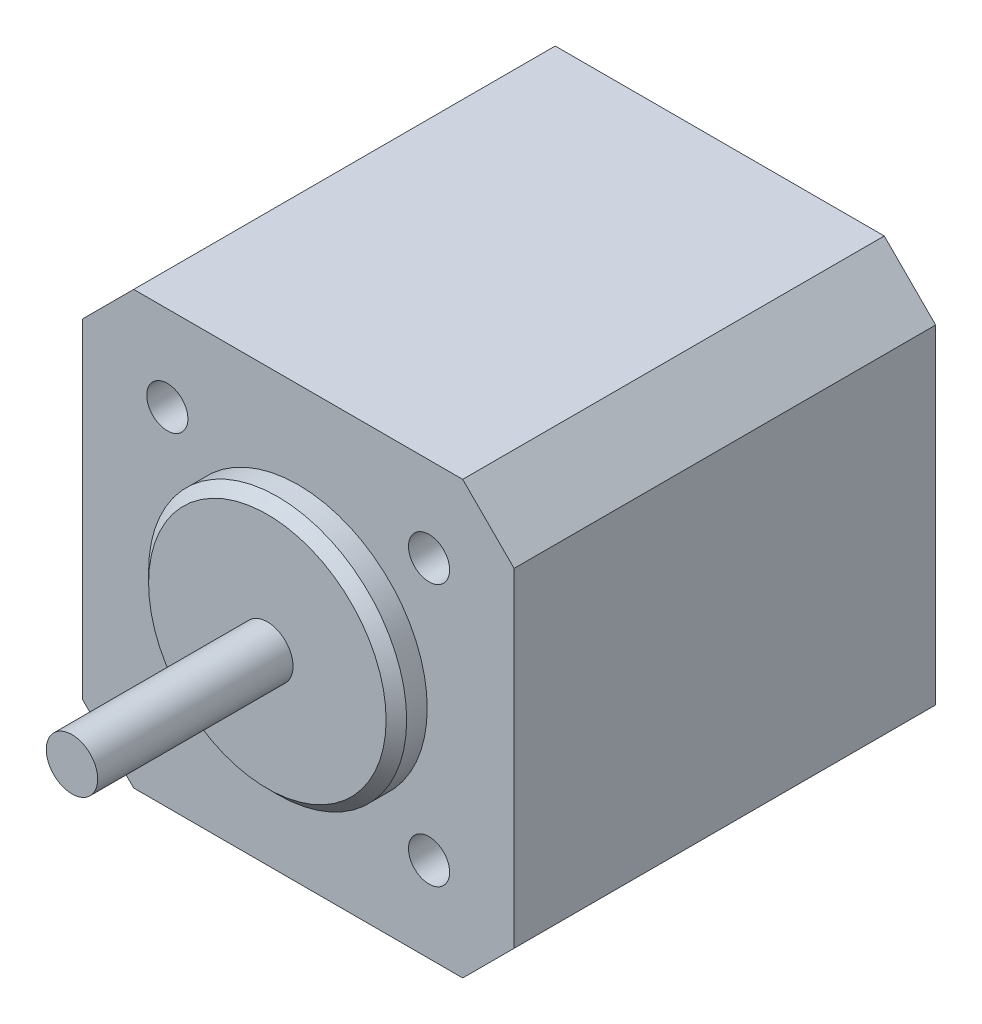
ISO-10303-21;
HEADER;
FILE_DESCRIPTION(('STEP AP214'),'2;1');
FILE_NAME('part.step','',(''),(''),'','','');
FILE_SCHEMA(('AUTOMOTIVE_DESIGN { 1 0 10303 214 1 1 1 1 }'));
ENDSEC;
DATA;
#1=APPLICATION_CONTEXT('core data for automotive mechanical design processes');
#2=APPLICATION_PROTOCOL_DEFINITION('international standard','automotive_design',2000,#1);
#3=PRODUCT_CONTEXT('',#1,'mechanical');
#4=PRODUCT('Part','Part','',(#3));
#5=PRODUCT_RELATED_PRODUCT_CATEGORY('part','',(#4));
#6=PRODUCT_DEFINITION_FORMATION('','',#4);
#7=PRODUCT_DEFINITION_CONTEXT('part definition',#1,'design');
#8=PRODUCT_DEFINITION('design','',#6,#7);
#9=PRODUCT_DEFINITION_SHAPE('','',#8);
#10=(LENGTH_UNIT() NAMED_UNIT(*) SI_UNIT(.MILLI.,.METRE.));
#11=(NAMED_UNIT(*) PLANE_ANGLE_UNIT() SI_UNIT($,.RADIAN.));
#12=(NAMED_UNIT(*) SI_UNIT($,.STERADIAN.) SOLID_ANGLE_UNIT());
#13=UNCERTAINTY_MEASURE_WITH_UNIT(LENGTH_MEASURE(1.E-05),#10,'distance_accuracy_value','');
#14=(GEOMETRIC_REPRESENTATION_CONTEXT(3) GLOBAL_UNCERTAINTY_ASSIGNED_CONTEXT((#13)) GLOBAL_UNIT_ASSIGNED_CONTEXT((#10,
#11,#12)) REPRESENTATION_CONTEXT('',''));
#15=CARTESIAN_POINT('',(0.,0.,0.));
#16=DIRECTION('',(0.,0.,1.));
#17=DIRECTION('',(1.,0.,0.));
#18=AXIS2_PLACEMENT_3D('',#15,#16,#17);
#19=CARTESIAN_POINT('',(0.,0.,41.));
#20=DIRECTION('',(0.,0.,1.));
#21=DIRECTION('',(1.,0.,0.));
#22=AXIS2_PLACEMENT_3D('',#19,#20,#21);
#23=PLANE('',#22);
#24=CARTESIAN_POINT('',(0.,0.,41.));
#25=DIRECTION('',(0.,0.,1.));
#26=DIRECTION('',(1.,0.,0.));
#27=AXIS2_PLACEMENT_3D('',#24,#25,#26);
#28=CIRCLE('',#27,12.55);
#29=CARTESIAN_POINT('',(12.55,0.,41.));
#30=VERTEX_POINT('',#29);
#31=EDGE_CURVE('E202',#30,#30,#28,.T.);
#32=ORIENTED_EDGE('',*,*,#31,.F.);
#33=EDGE_LOOP('',(#32));
#34=FACE_BOUND('',#33,.T.);
#35=CARTESIAN_POINT('',(-12.7279220613572,-12.7279220613586,41.));
#36=DIRECTION('',(0.,0.,1.));
#37=DIRECTION('',(1.,0.,0.));
#38=AXIS2_PLACEMENT_3D('',#35,#36,#37);
#39=CIRCLE('',#38,2.00000000000052);
#40=CARTESIAN_POINT('',(-10.7279220613566,-12.7279220613586,41.));
#41=VERTEX_POINT('',#40);
#42=EDGE_CURVE('E215',#41,#41,#39,.T.);
#43=ORIENTED_EDGE('',*,*,#42,.F.);
#44=EDGE_LOOP('',(#43));
#45=FACE_BOUND('',#44,.T.);
#46=CARTESIAN_POINT('',(12.7279220613579,12.7279220613579,41.));
#47=DIRECTION('',(0.,0.,1.));
#48=DIRECTION('',(1.,0.,0.));
#49=AXIS2_PLACEMENT_3D('',#46,#47,#48);
#50=CIRCLE('',#49,2.);
#51=CARTESIAN_POINT('',(14.7279220613579,12.7279220613579,41.));
#52=VERTEX_POINT('',#51);
#53=EDGE_CURVE('E150',#52,#52,#50,.T.);
#54=ORIENTED_EDGE('',*,*,#53,.F.);
#55=EDGE_LOOP('',(#54));
#56=FACE_BOUND('',#55,.T.);
#57=DIRECTION('',(-1.,0.,0.));
#58=VECTOR('',#57,1.);
#59=CARTESIAN_POINT('',(-16.,21.,41.));
#60=LINE('',#59,#58);
#61=CARTESIAN_POINT('',(16.,21.,41.));
#62=VERTEX_POINT('',#61);
#63=CARTESIAN_POINT('',(-16.,21.,41.));
#64=VERTEX_POINT('',#63);
#65=EDGE_CURVE('E168',#62,#64,#60,.T.);
#66=ORIENTED_EDGE('',*,*,#65,.T.);
#67=DIRECTION('',(-0.707106781186548,-0.707106781186548,0.));
#68=VECTOR('',#67,1.);
#69=CARTESIAN_POINT('',(-21.,16.,41.));
#70=LINE('',#69,#68);
#71=CARTESIAN_POINT('',(-21.,16.,41.));
#72=VERTEX_POINT('',#71);
#73=EDGE_CURVE('E104',#64,#72,#70,.T.);
#74=ORIENTED_EDGE('',*,*,#73,.T.);
#75=DIRECTION('',(0.,-1.,0.));
#76=VECTOR('',#75,1.);
#77=CARTESIAN_POINT('',(-21.,-16.,41.));
#78=LINE('',#77,#76);
#79=CARTESIAN_POINT('',(-21.,-16.,41.));
#80=VERTEX_POINT('',#79);
#81=EDGE_CURVE('E241',#72,#80,#78,.T.);
#82=ORIENTED_EDGE('',*,*,#81,.T.);
#83=DIRECTION('',(0.707106781186548,-0.707106781186548,0.));
#84=VECTOR('',#83,1.);
#85=CARTESIAN_POINT('',(-16.,-21.,41.));
#86=LINE('',#85,#84);
#87=CARTESIAN_POINT('',(-16.,-21.,41.));
#88=VERTEX_POINT('',#87);
#89=EDGE_CURVE('E244',#80,#88,#86,.T.);
#90=ORIENTED_EDGE('',*,*,#89,.T.);
#91=DIRECTION('',(1.,0.,0.));
#92=VECTOR('',#91,1.);
#93=CARTESIAN_POINT('',(-16.,-21.,41.));
#94=LINE('',#93,#92);
#95=CARTESIAN_POINT('',(16.,-21.,41.));
#96=VERTEX_POINT('',#95);
#97=EDGE_CURVE('E123',#88,#96,#94,.T.);
#98=ORIENTED_EDGE('',*,*,#97,.T.);
#99=DIRECTION('',(0.707106781186547,0.707106781186548,0.));
#100=VECTOR('',#99,1.);
#101=CARTESIAN_POINT('',(16.,-21.,41.));
#102=LINE('',#101,#100);
#103=CARTESIAN_POINT('',(21.,-16.,41.));
#104=VERTEX_POINT('',#103);
#105=EDGE_CURVE('E117',#96,#104,#102,.T.);
#106=ORIENTED_EDGE('',*,*,#105,.T.);
#107=DIRECTION('',(0.,1.,0.));
#108=VECTOR('',#107,1.);
#109=CARTESIAN_POINT('',(21.,-16.,41.));
#110=LINE('',#109,#108);
#111=CARTESIAN_POINT('',(21.,16.,41.));
#112=VERTEX_POINT('',#111);
#113=EDGE_CURVE('E121',#104,#112,#110,.T.);
#114=ORIENTED_EDGE('',*,*,#113,.T.);
#115=DIRECTION('',(-0.707106781186548,0.707106781186548,0.));
#116=VECTOR('',#115,1.);
#117=CARTESIAN_POINT('',(16.,21.,41.));
#118=LINE('',#117,#116);
#119=EDGE_CURVE('E60',#112,#62,#118,.T.);
#120=ORIENTED_EDGE('',*,*,#119,.T.);
#121=EDGE_LOOP('',(#66,#74,#82,#90,#98,#106,#114,#120));
#122=FACE_BOUND('',#121,.T.);
#123=CARTESIAN_POINT('',(12.7279220613586,-12.7279220613579,41.));
#124=DIRECTION('',(0.,0.,1.));
#125=DIRECTION('',(1.,0.,0.));
#126=AXIS2_PLACEMENT_3D('',#123,#124,#125);
#127=CIRCLE('',#126,1.99999999999982);
#128=CARTESIAN_POINT('',(14.7279220613584,-12.7279220613579,41.));
#129=VERTEX_POINT('',#128);
#130=EDGE_CURVE('E223',#129,#129,#127,.T.);
#131=ORIENTED_EDGE('',*,*,#130,.F.);
#132=EDGE_LOOP('',(#131));
#133=FACE_BOUND('',#132,.T.);
#134=CARTESIAN_POINT('',(-12.7279220613579,12.7279220613572,41.));
#135=DIRECTION('',(0.,0.,1.));
#136=DIRECTION('',(1.,0.,0.));
#137=AXIS2_PLACEMENT_3D('',#134,#135,#136);
#138=CIRCLE('',#137,2.00000000000076);
#139=CARTESIAN_POINT('',(-10.7279220613571,12.7279220613572,41.));
#140=VERTEX_POINT('',#139);
#141=EDGE_CURVE('E207',#140,#140,#138,.T.);
#142=ORIENTED_EDGE('',*,*,#141,.F.);
#143=EDGE_LOOP('',(#142));
#144=FACE_BOUND('',#143,.T.);
#145=ADVANCED_FACE('F41',(#34,#45,#56,#122,#133,#144),#23,.T.);
#146=CARTESIAN_POINT('',(0.,0.,0.));
#147=DIRECTION('',(0.,0.,1.));
#148=DIRECTION('',(1.,0.,0.));
#149=AXIS2_PLACEMENT_3D('',#146,#147,#148);
#150=PLANE('',#149);
#151=DIRECTION('',(-1.,0.,0.));
#152=VECTOR('',#151,1.);
#153=CARTESIAN_POINT('',(-16.,21.,0.));
#154=LINE('',#153,#152);
#155=CARTESIAN_POINT('',(16.,21.,0.));
#156=VERTEX_POINT('',#155);
#157=CARTESIAN_POINT('',(-16.,21.,0.));
#158=VERTEX_POINT('',#157);
#159=EDGE_CURVE('E145',#156,#158,#154,.T.);
#160=ORIENTED_EDGE('',*,*,#159,.F.);
#161=DIRECTION('',(-0.707106781186548,0.707106781186548,0.));
#162=VECTOR('',#161,1.);
#163=CARTESIAN_POINT('',(16.,21.,0.));
#164=LINE('',#163,#162);
#165=CARTESIAN_POINT('',(21.,16.,0.));
#166=VERTEX_POINT('',#165);
#167=EDGE_CURVE('E95',#166,#156,#164,.T.);
#168=ORIENTED_EDGE('',*,*,#167,.F.);
#169=DIRECTION('',(0.,1.,0.));
#170=VECTOR('',#169,1.);
#171=CARTESIAN_POINT('',(21.,-16.,0.));
#172=LINE('',#171,#170);
#173=CARTESIAN_POINT('',(21.,-16.,0.));
#174=VERTEX_POINT('',#173);
#175=EDGE_CURVE('E89',#174,#166,#172,.T.);
#176=ORIENTED_EDGE('',*,*,#175,.F.);
#177=DIRECTION('',(0.707106781186547,0.707106781186548,0.));
#178=VECTOR('',#177,1.);
#179=CARTESIAN_POINT('',(16.,-21.,0.));
#180=LINE('',#179,#178);
#181=CARTESIAN_POINT('',(16.,-21.,0.));
#182=VERTEX_POINT('',#181);
#183=EDGE_CURVE('E132',#182,#174,#180,.T.);
#184=ORIENTED_EDGE('',*,*,#183,.F.);
#185=DIRECTION('',(1.,0.,0.));
#186=VECTOR('',#185,1.);
#187=CARTESIAN_POINT('',(-16.,-21.,0.));
#188=LINE('',#187,#186);
#189=CARTESIAN_POINT('',(-16.,-21.,0.));
#190=VERTEX_POINT('',#189);
#191=EDGE_CURVE('E159',#190,#182,#188,.T.);
#192=ORIENTED_EDGE('',*,*,#191,.F.);
#193=DIRECTION('',(0.707106781186548,-0.707106781186548,0.));
#194=VECTOR('',#193,1.);
#195=CARTESIAN_POINT('',(-16.,-21.,0.));
#196=LINE('',#195,#194);
#197=CARTESIAN_POINT('',(-21.,-16.,0.));
#198=VERTEX_POINT('',#197);
#199=EDGE_CURVE('E156',#198,#190,#196,.T.);
#200=ORIENTED_EDGE('',*,*,#199,.F.);
#201=DIRECTION('',(0.,-1.,0.));
#202=VECTOR('',#201,1.);
#203=CARTESIAN_POINT('',(-21.,-16.,0.));
#204=LINE('',#203,#202);
#205=CARTESIAN_POINT('',(-21.,16.,0.));
#206=VERTEX_POINT('',#205);
#207=EDGE_CURVE('E153',#206,#198,#204,.T.);
#208=ORIENTED_EDGE('',*,*,#207,.F.);
#209=DIRECTION('',(-0.707106781186548,-0.707106781186548,0.));
#210=VECTOR('',#209,1.);
#211=CARTESIAN_POINT('',(-21.,16.,0.));
#212=LINE('',#211,#210);
#213=EDGE_CURVE('E149',#158,#206,#212,.T.);
#214=ORIENTED_EDGE('',*,*,#213,.F.);
#215=EDGE_LOOP('',(#160,#168,#176,#184,#192,#200,#208,#214));
#216=FACE_BOUND('',#215,.T.);
#217=CARTESIAN_POINT('',(12.7279220613579,12.7279220613579,0.));
#218=DIRECTION('',(0.,0.,1.));
#219=DIRECTION('',(1.,0.,0.));
#220=AXIS2_PLACEMENT_3D('',#217,#218,#219);
#221=CIRCLE('',#220,2.);
#222=CARTESIAN_POINT('',(14.7279220613579,12.7279220613579,0.));
#223=VERTEX_POINT('',#222);
#224=EDGE_CURVE('E227',#223,#223,#221,.T.);
#225=ORIENTED_EDGE('',*,*,#224,.T.);
#226=EDGE_LOOP('',(#225));
#227=FACE_BOUND('',#226,.T.);
#228=CARTESIAN_POINT('',(12.7279220613586,-12.7279220613579,0.));
#229=DIRECTION('',(0.,0.,1.));
#230=DIRECTION('',(1.,0.,0.));
#231=AXIS2_PLACEMENT_3D('',#228,#229,#230);
#232=CIRCLE('',#231,1.99999999999982);
#233=CARTESIAN_POINT('',(14.7279220613584,-12.7279220613579,0.));
#234=VERTEX_POINT('',#233);
#235=EDGE_CURVE('E219',#234,#234,#232,.T.);
#236=ORIENTED_EDGE('',*,*,#235,.T.);
#237=EDGE_LOOP('',(#236));
#238=FACE_BOUND('',#237,.T.);
#239=CARTESIAN_POINT('',(-12.7279220613572,-12.7279220613586,0.));
#240=DIRECTION('',(0.,0.,1.));
#241=DIRECTION('',(1.,0.,0.));
#242=AXIS2_PLACEMENT_3D('',#239,#240,#241);
#243=CIRCLE('',#242,2.00000000000052);
#244=CARTESIAN_POINT('',(-10.7279220613566,-12.7279220613586,0.));
#245=VERTEX_POINT('',#244);
#246=EDGE_CURVE('E211',#245,#245,#243,.T.);
#247=ORIENTED_EDGE('',*,*,#246,.T.);
#248=EDGE_LOOP('',(#247));
#249=FACE_BOUND('',#248,.T.);
#250=CARTESIAN_POINT('',(-12.7279220613579,12.7279220613572,0.));
#251=DIRECTION('',(0.,0.,1.));
#252=DIRECTION('',(1.,0.,0.));
#253=AXIS2_PLACEMENT_3D('',#250,#251,#252);
#254=CIRCLE('',#253,2.00000000000076);
#255=CARTESIAN_POINT('',(-10.7279220613571,12.7279220613572,0.));
#256=VERTEX_POINT('',#255);
#257=EDGE_CURVE('E206',#256,#256,#254,.T.);
#258=ORIENTED_EDGE('',*,*,#257,.T.);
#259=EDGE_LOOP('',(#258));
#260=FACE_BOUND('',#259,.T.);
#261=ADVANCED_FACE('F265',(#216,#227,#238,#249,#260),#150,.F.);
#262=CARTESIAN_POINT('',(-16.,21.,41.));
#263=DIRECTION('',(0.,-1.,0.));
#264=DIRECTION('',(0.,0.,-1.));
#265=AXIS2_PLACEMENT_3D('',#262,#263,#264);
#266=PLANE('',#265);
#267=ORIENTED_EDGE('',*,*,#159,.T.);
#268=DIRECTION('',(0.,0.,-1.));
#269=VECTOR('',#268,1.);
#270=CARTESIAN_POINT('',(-16.,21.,41.));
#271=LINE('',#270,#269);
#272=EDGE_CURVE('E187',#64,#158,#271,.T.);
#273=ORIENTED_EDGE('',*,*,#272,.F.);
#274=ORIENTED_EDGE('',*,*,#65,.F.);
#275=DIRECTION('',(0.,0.,-1.));
#276=VECTOR('',#275,1.);
#277=CARTESIAN_POINT('',(16.,21.,41.));
#278=LINE('',#277,#276);
#279=EDGE_CURVE('E141',#62,#156,#278,.T.);
#280=ORIENTED_EDGE('',*,*,#279,.T.);
#281=EDGE_LOOP('',(#267,#273,#274,#280));
#282=FACE_BOUND('',#281,.T.);
#283=ADVANCED_FACE('F271',(#282),#266,.F.);
#284=CARTESIAN_POINT('',(-21.,16.,41.));
#285=DIRECTION('',(0.707106781186547,-0.707106781186547,0.));
#286=DIRECTION('',(0.707106781186548,0.707106781186548,0.));
#287=AXIS2_PLACEMENT_3D('',#284,#285,#286);
#288=PLANE('',#287);
#289=ORIENTED_EDGE('',*,*,#213,.T.);
#290=DIRECTION('',(0.,0.,-1.));
#291=VECTOR('',#290,1.);
#292=CARTESIAN_POINT('',(-21.,16.,41.));
#293=LINE('',#292,#291);
#294=EDGE_CURVE('E183',#72,#206,#293,.T.);
#295=ORIENTED_EDGE('',*,*,#294,.F.);
#296=ORIENTED_EDGE('',*,*,#73,.F.);
#297=ORIENTED_EDGE('',*,*,#272,.T.);
#298=EDGE_LOOP('',(#289,#295,#296,#297));
#299=FACE_BOUND('',#298,.T.);
#300=ADVANCED_FACE('F298',(#299),#288,.F.);
#301=CARTESIAN_POINT('',(-21.,-16.,41.));
#302=DIRECTION('',(1.,0.,0.));
#303=DIRECTION('',(0.,0.,-1.));
#304=AXIS2_PLACEMENT_3D('',#301,#302,#303);
#305=PLANE('',#304);
#306=ORIENTED_EDGE('',*,*,#207,.T.);
#307=DIRECTION('',(0.,0.,-1.));
#308=VECTOR('',#307,1.);
#309=CARTESIAN_POINT('',(-21.,-16.,41.));
#310=LINE('',#309,#308);
#311=EDGE_CURVE('E179',#80,#198,#310,.T.);
#312=ORIENTED_EDGE('',*,*,#311,.F.);
#313=ORIENTED_EDGE('',*,*,#81,.F.);
#314=ORIENTED_EDGE('',*,*,#294,.T.);
#315=EDGE_LOOP('',(#306,#312,#313,#314));
#316=FACE_BOUND('',#315,.T.);
#317=ADVANCED_FACE('F294',(#316),#305,.F.);
#318=CARTESIAN_POINT('',(-16.,-21.,41.));
#319=DIRECTION('',(0.707106781186547,0.707106781186547,0.));
#320=DIRECTION('',(-0.707106781186548,0.707106781186548,0.));
#321=AXIS2_PLACEMENT_3D('',#318,#319,#320);
#322=PLANE('',#321);
#323=ORIENTED_EDGE('',*,*,#199,.T.);
#324=DIRECTION('',(0.,0.,-1.));
#325=VECTOR('',#324,1.);
#326=CARTESIAN_POINT('',(-16.,-21.,41.));
#327=LINE('',#326,#325);
#328=EDGE_CURVE('E175',#88,#190,#327,.T.);
#329=ORIENTED_EDGE('',*,*,#328,.F.);
#330=ORIENTED_EDGE('',*,*,#89,.F.);
#331=ORIENTED_EDGE('',*,*,#311,.T.);
#332=EDGE_LOOP('',(#323,#329,#330,#331));
#333=FACE_BOUND('',#332,.T.);
#334=ADVANCED_FACE('F290',(#333),#322,.F.);
#335=CARTESIAN_POINT('',(-16.,-21.,41.));
#336=DIRECTION('',(0.,1.,0.));
#337=DIRECTION('',(0.,0.,1.));
#338=AXIS2_PLACEMENT_3D('',#335,#336,#337);
#339=PLANE('',#338);
#340=ORIENTED_EDGE('',*,*,#191,.T.);
#341=DIRECTION('',(0.,0.,-1.));
#342=VECTOR('',#341,1.);
#343=CARTESIAN_POINT('',(16.,-21.,41.));
#344=LINE('',#343,#342);
#345=EDGE_CURVE('E134',#96,#182,#344,.T.);
#346=ORIENTED_EDGE('',*,*,#345,.F.);
#347=ORIENTED_EDGE('',*,*,#97,.F.);
#348=ORIENTED_EDGE('',*,*,#328,.T.);
#349=EDGE_LOOP('',(#340,#346,#347,#348));
#350=FACE_BOUND('',#349,.T.);
#351=ADVANCED_FACE('F287',(#350),#339,.F.);
#352=CARTESIAN_POINT('',(16.,-21.,41.));
#353=DIRECTION('',(-0.707106781186548,0.707106781186547,0.));
#354=DIRECTION('',(-0.707106781186547,-0.707106781186548,0.));
#355=AXIS2_PLACEMENT_3D('',#352,#353,#354);
#356=PLANE('',#355);
#357=ORIENTED_EDGE('',*,*,#183,.T.);
#358=DIRECTION('',(0.,0.,-1.));
#359=VECTOR('',#358,1.);
#360=CARTESIAN_POINT('',(21.,-16.,41.));
#361=LINE('',#360,#359);
#362=EDGE_CURVE('E129',#104,#174,#361,.T.);
#363=ORIENTED_EDGE('',*,*,#362,.F.);
#364=ORIENTED_EDGE('',*,*,#105,.F.);
#365=ORIENTED_EDGE('',*,*,#345,.T.);
#366=EDGE_LOOP('',(#357,#363,#364,#365));
#367=FACE_BOUND('',#366,.T.);
#368=ADVANCED_FACE('F130',(#367),#356,.F.);
#369=CARTESIAN_POINT('',(21.,-16.,41.));
#370=DIRECTION('',(-1.,0.,0.));
#371=DIRECTION('',(0.,-1.,0.));
#372=AXIS2_PLACEMENT_3D('',#369,#370,#371);
#373=PLANE('',#372);
#374=ORIENTED_EDGE('',*,*,#175,.T.);
#375=DIRECTION('',(0.,0.,-1.));
#376=VECTOR('',#375,1.);
#377=CARTESIAN_POINT('',(21.,16.,41.));
#378=LINE('',#377,#376);
#379=EDGE_CURVE('E135',#112,#166,#378,.T.);
#380=ORIENTED_EDGE('',*,*,#379,.F.);
#381=ORIENTED_EDGE('',*,*,#113,.F.);
#382=ORIENTED_EDGE('',*,*,#362,.T.);
#383=EDGE_LOOP('',(#374,#380,#381,#382));
#384=FACE_BOUND('',#383,.T.);
#385=ADVANCED_FACE('F137',(#384),#373,.F.);
#386=CARTESIAN_POINT('',(16.,21.,41.));
#387=DIRECTION('',(-0.707106781186547,-0.707106781186547,0.));
#388=DIRECTION('',(0.707106781186548,-0.707106781186548,0.));
#389=AXIS2_PLACEMENT_3D('',#386,#387,#388);
#390=PLANE('',#389);
#391=ORIENTED_EDGE('',*,*,#167,.T.);
#392=ORIENTED_EDGE('',*,*,#279,.F.);
#393=ORIENTED_EDGE('',*,*,#119,.F.);
#394=ORIENTED_EDGE('',*,*,#379,.T.);
#395=EDGE_LOOP('',(#391,#392,#393,#394));
#396=FACE_BOUND('',#395,.T.);
#397=ADVANCED_FACE('F280',(#396),#390,.F.);
#398=CARTESIAN_POINT('',(12.7279220613579,12.7279220613579,41.));
#399=DIRECTION('',(0.,0.,-1.));
#400=DIRECTION('',(-1.,0.,0.));
#401=AXIS2_PLACEMENT_3D('',#398,#399,#400);
#402=CYLINDRICAL_SURFACE('',#401,2.);
#403=ORIENTED_EDGE('',*,*,#53,.T.);
#404=EDGE_LOOP('',(#403));
#405=FACE_BOUND('',#404,.T.);
#406=ORIENTED_EDGE('',*,*,#224,.F.);
#407=EDGE_LOOP('',(#406));
#408=FACE_BOUND('',#407,.T.);
#409=ADVANCED_FACE('F277',(#405,#408),#402,.F.);
#410=CARTESIAN_POINT('',(12.7279220613586,-12.7279220613579,41.));
#411=DIRECTION('',(0.,0.,-1.));
#412=DIRECTION('',(-1.,0.,0.));
#413=AXIS2_PLACEMENT_3D('',#410,#411,#412);
#414=CYLINDRICAL_SURFACE('',#413,1.99999999999982);
#415=ORIENTED_EDGE('',*,*,#130,.T.);
#416=EDGE_LOOP('',(#415));
#417=FACE_BOUND('',#416,.T.);
#418=ORIENTED_EDGE('',*,*,#235,.F.);
#419=EDGE_LOOP('',(#418));
#420=FACE_BOUND('',#419,.T.);
#421=ADVANCED_FACE('F335',(#417,#420),#414,.F.);
#422=CARTESIAN_POINT('',(-12.7279220613572,-12.7279220613586,41.));
#423=DIRECTION('',(0.,0.,-1.));
#424=DIRECTION('',(-1.,0.,0.));
#425=AXIS2_PLACEMENT_3D('',#422,#423,#424);
#426=CYLINDRICAL_SURFACE('',#425,2.00000000000052);
#427=ORIENTED_EDGE('',*,*,#42,.T.);
#428=EDGE_LOOP('',(#427));
#429=FACE_BOUND('',#428,.T.);
#430=ORIENTED_EDGE('',*,*,#246,.F.);
#431=EDGE_LOOP('',(#430));
#432=FACE_BOUND('',#431,.T.);
#433=ADVANCED_FACE('F326',(#429,#432),#426,.F.);
#434=CARTESIAN_POINT('',(-12.7279220613579,12.7279220613572,41.));
#435=DIRECTION('',(0.,0.,-1.));
#436=DIRECTION('',(-1.,0.,0.));
#437=AXIS2_PLACEMENT_3D('',#434,#435,#436);
#438=CYLINDRICAL_SURFACE('',#437,2.00000000000076);
#439=ORIENTED_EDGE('',*,*,#141,.T.);
#440=EDGE_LOOP('',(#439));
#441=FACE_BOUND('',#440,.T.);
#442=ORIENTED_EDGE('',*,*,#257,.F.);
#443=EDGE_LOOP('',(#442));
#444=FACE_BOUND('',#443,.T.);
#445=ADVANCED_FACE('F324',(#441,#444),#438,.F.);
#446=CARTESIAN_POINT('',(0.,0.,44.));
#447=DIRECTION('',(0.,0.,-1.));
#448=DIRECTION('',(-1.,0.,0.));
#449=AXIS2_PLACEMENT_3D('',#446,#447,#448);
#450=CYLINDRICAL_SURFACE('',#449,12.55);
#451=CARTESIAN_POINT('',(0.,0.,43.));
#452=DIRECTION('',(0.,0.,1.));
#453=DIRECTION('',(1.,0.,0.));
#454=AXIS2_PLACEMENT_3D('',#451,#452,#453);
#455=CIRCLE('',#454,12.55);
#456=CARTESIAN_POINT('',(12.55,0.,43.));
#457=VERTEX_POINT('',#456);
#458=EDGE_CURVE('E11',#457,#457,#455,.F.);
#459=ORIENTED_EDGE('',*,*,#458,.T.);
#460=EDGE_LOOP('',(#459));
#461=FACE_BOUND('',#460,.T.);
#462=ORIENTED_EDGE('',*,*,#31,.T.);
#463=EDGE_LOOP('',(#462));
#464=FACE_BOUND('',#463,.T.);
#465=ADVANCED_FACE('F262',(#461,#464),#450,.T.);
#466=CARTESIAN_POINT('',(0.,0.,44.));
#467=DIRECTION('',(0.,0.,1.));
#468=DIRECTION('',(1.,0.,0.));
#469=AXIS2_PLACEMENT_3D('',#466,#467,#468);
#470=PLANE('',#469);
#471=CARTESIAN_POINT('',(0.,0.,44.));
#472=DIRECTION('',(0.,0.,1.));
#473=DIRECTION('',(1.,0.,0.));
#474=AXIS2_PLACEMENT_3D('',#471,#472,#473);
#475=CIRCLE('',#474,11.55);
#476=CARTESIAN_POINT('',(11.55,0.,44.));
#477=VERTEX_POINT('',#476);
#478=EDGE_CURVE('E52',#477,#477,#475,.T.);
#479=ORIENTED_EDGE('',*,*,#478,.T.);
#480=EDGE_LOOP('',(#479));
#481=FACE_BOUND('',#480,.T.);
#482=CARTESIAN_POINT('',(0.,0.,44.));
#483=DIRECTION('',(0.,0.,1.));
#484=DIRECTION('',(1.,0.,0.));
#485=AXIS2_PLACEMENT_3D('',#482,#483,#484);
#486=CIRCLE('',#485,2.5);
#487=CARTESIAN_POINT('',(2.5,0.,44.));
#488=VERTEX_POINT('',#487);
#489=EDGE_CURVE('E189',#488,#488,#486,.T.);
#490=ORIENTED_EDGE('',*,*,#489,.F.);
#491=EDGE_LOOP('',(#490));
#492=FACE_BOUND('',#491,.T.);
#493=ADVANCED_FACE('F255',(#481,#492),#470,.T.);
#494=CARTESIAN_POINT('',(0.,0.,63.));
#495=DIRECTION('',(0.,0.,-1.));
#496=DIRECTION('',(-1.,0.,0.));
#497=AXIS2_PLACEMENT_3D('',#494,#495,#496);
#498=CYLINDRICAL_SURFACE('',#497,2.5);
#499=CARTESIAN_POINT('',(0.,0.,63.));
#500=DIRECTION('',(0.,0.,1.));
#501=DIRECTION('',(1.,0.,0.));
#502=AXIS2_PLACEMENT_3D('',#499,#500,#501);
#503=CIRCLE('',#502,2.5);
#504=CARTESIAN_POINT('',(2.5,0.,63.));
#505=VERTEX_POINT('',#504);
#506=EDGE_CURVE('E201',#505,#505,#503,.T.);
#507=ORIENTED_EDGE('',*,*,#506,.F.);
#508=EDGE_LOOP('',(#507));
#509=FACE_BOUND('',#508,.T.);
#510=ORIENTED_EDGE('',*,*,#489,.T.);
#511=EDGE_LOOP('',(#510));
#512=FACE_BOUND('',#511,.T.);
#513=ADVANCED_FACE('F253',(#509,#512),#498,.T.);
#514=CARTESIAN_POINT('',(0.,0.,63.));
#515=DIRECTION('',(0.,0.,1.));
#516=DIRECTION('',(1.,0.,0.));
#517=AXIS2_PLACEMENT_3D('',#514,#515,#516);
#518=PLANE('',#517);
#519=ORIENTED_EDGE('',*,*,#506,.T.);
#520=EDGE_LOOP('',(#519));
#521=FACE_BOUND('',#520,.T.);
#522=ADVANCED_FACE('F251',(#521),#518,.T.);
#523=CARTESIAN_POINT('',(0.,0.,44.));
#524=DIRECTION('',(0.,0.,-1.));
#525=DIRECTION('',(-1.,0.,0.));
#526=AXIS2_PLACEMENT_3D('',#523,#524,#525);
#527=CONICAL_SURFACE('',#526,11.55,0.785398163397446);
#528=ORIENTED_EDGE('',*,*,#458,.F.);
#529=EDGE_LOOP('',(#528));
#530=FACE_BOUND('',#529,.T.);
#531=ORIENTED_EDGE('',*,*,#478,.F.);
#532=EDGE_LOOP('',(#531));
#533=FACE_BOUND('',#532,.T.);
#534=ADVANCED_FACE('F44',(#530,#533),#527,.T.);
#535=CLOSED_SHELL('',(#145,#261,#283,#300,#317,#334,#351,#368,#385,#397,#409,#421,#433,#445,
#465,#493,#513,#522,#534));
#536=MANIFOLD_SOLID_BREP('B2',#535);
#537=ADVANCED_BREP_SHAPE_REPRESENTATION('',(#18,#536),#14);
#538=SHAPE_DEFINITION_REPRESENTATION(#9,#537);
ENDSEC;
END-ISO-10303-21;
